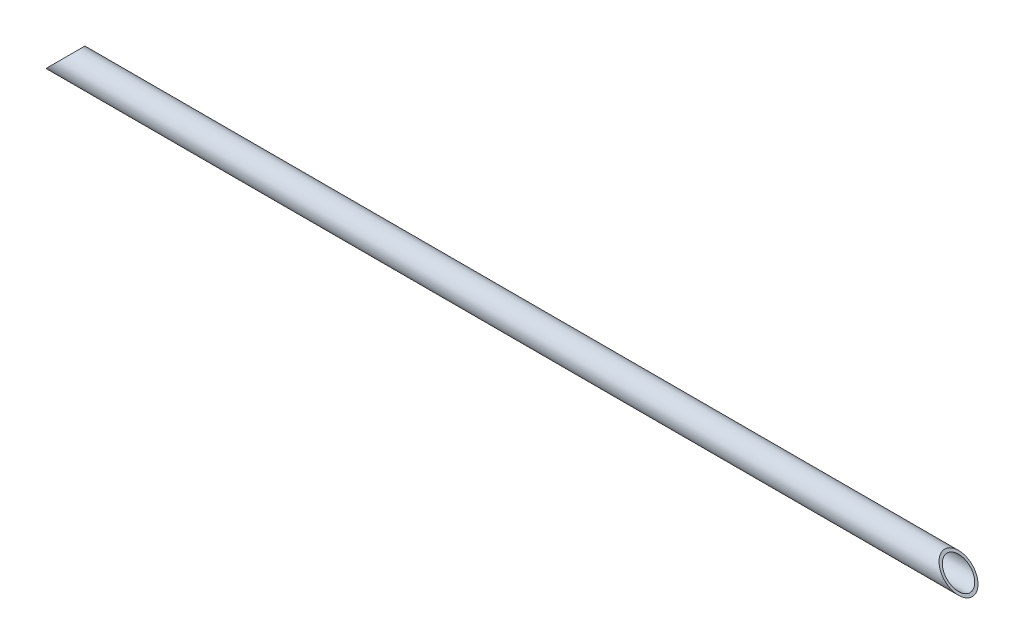
ISO-10303-21;
HEADER;
FILE_DESCRIPTION(('STEP AP214'),'2;1');
FILE_NAME('part.step','',(''),(''),'','','');
FILE_SCHEMA(('AUTOMOTIVE_DESIGN { 1 0 10303 214 1 1 1 1 }'));
ENDSEC;
DATA;
#1=APPLICATION_CONTEXT('core data for automotive mechanical design processes');
#2=APPLICATION_PROTOCOL_DEFINITION('international standard','automotive_design',2000,#1);
#3=PRODUCT_CONTEXT('',#1,'mechanical');
#4=PRODUCT('Part','Part','',(#3));
#5=PRODUCT_RELATED_PRODUCT_CATEGORY('part','',(#4));
#6=PRODUCT_DEFINITION_FORMATION('','',#4);
#7=PRODUCT_DEFINITION_CONTEXT('part definition',#1,'design');
#8=PRODUCT_DEFINITION('design','',#6,#7);
#9=PRODUCT_DEFINITION_SHAPE('','',#8);
#10=(LENGTH_UNIT() NAMED_UNIT(*) SI_UNIT(.MILLI.,.METRE.));
#11=(NAMED_UNIT(*) PLANE_ANGLE_UNIT() SI_UNIT($,.RADIAN.));
#12=(NAMED_UNIT(*) SI_UNIT($,.STERADIAN.) SOLID_ANGLE_UNIT());
#13=UNCERTAINTY_MEASURE_WITH_UNIT(LENGTH_MEASURE(1.E-05),#10,'distance_accuracy_value','');
#14=(GEOMETRIC_REPRESENTATION_CONTEXT(3) GLOBAL_UNCERTAINTY_ASSIGNED_CONTEXT((#13)) GLOBAL_UNIT_ASSIGNED_CONTEXT((#10,
#11,#12)) REPRESENTATION_CONTEXT('',''));
#15=CARTESIAN_POINT('',(0.,0.,0.));
#16=DIRECTION('',(0.,0.,1.));
#17=DIRECTION('',(1.,0.,0.));
#18=AXIS2_PLACEMENT_3D('',#15,#16,#17);
#19=CARTESIAN_POINT('',(704.85,-133.554831147194,21.5490330010652));
#20=DIRECTION('',(1.,0.,0.));
#21=DIRECTION('',(0.,0.,-1.));
#22=AXIS2_PLACEMENT_3D('',#19,#20,#21);
#23=CYLINDRICAL_SURFACE('',#22,17.526);
#24=CARTESIAN_POINT('',(683.768,-133.554831147194,21.5490330010652));
#25=DIRECTION('',(0.707106781186548,0.707106781186547,0.));
#26=DIRECTION('',(0.707106781186547,-0.707106781186548,0.));
#27=AXIS2_PLACEMENT_3D('',#24,#25,#26);
#28=ELLIPSE('',#27,24.7855068941508,17.526);
#29=CARTESIAN_POINT('',(701.294,-151.080831147194,21.5490330010652));
#30=VERTEX_POINT('',#29);
#31=EDGE_CURVE('E24',#30,#30,#28,.F.);
#32=ORIENTED_EDGE('',*,*,#31,.F.);
#33=EDGE_LOOP('',(#32));
#34=FACE_BOUND('',#33,.T.);
#35=CARTESIAN_POINT('',(-683.768,-133.554831147194,21.5490330010652));
#36=DIRECTION('',(-0.707106781186547,0.707106781186548,0.));
#37=DIRECTION('',(0.707106781186548,0.707106781186547,0.));
#38=AXIS2_PLACEMENT_3D('',#35,#36,#37);
#39=ELLIPSE('',#38,24.7855068941509,17.526);
#40=CARTESIAN_POINT('',(-666.242,-116.028831147194,21.5490330010652));
#41=VERTEX_POINT('',#40);
#42=EDGE_CURVE('E15',#41,#41,#39,.F.);
#43=ORIENTED_EDGE('',*,*,#42,.F.);
#44=EDGE_LOOP('',(#43));
#45=FACE_BOUND('',#44,.T.);
#46=ADVANCED_FACE('F12',(#34,#45),#23,.F.);
#47=CARTESIAN_POINT('',(-685.787239538478,-135.574070685672,1502.067630764));
#48=DIRECTION('',(-0.707106781186547,0.707106781186548,0.));
#49=DIRECTION('',(-0.707106781186548,-0.707106781186547,0.));
#50=AXIS2_PLACEMENT_3D('',#47,#48,#49);
#51=PLANE('',#50);
#52=CARTESIAN_POINT('',(-683.768,-133.554831147194,21.5490330010652));
#53=DIRECTION('',(-0.707106781186547,0.707106781186548,0.));
#54=DIRECTION('',(0.707106781186548,0.707106781186547,0.));
#55=AXIS2_PLACEMENT_3D('',#52,#53,#54);
#56=ELLIPSE('',#55,29.8144503219496,21.082);
#57=CARTESIAN_POINT('',(-662.686,-112.472831147194,21.5490330010652));
#58=VERTEX_POINT('',#57);
#59=EDGE_CURVE('E19',#58,#58,#56,.F.);
#60=ORIENTED_EDGE('',*,*,#59,.F.);
#61=EDGE_LOOP('',(#60));
#62=FACE_BOUND('',#61,.T.);
#63=ORIENTED_EDGE('',*,*,#42,.T.);
#64=EDGE_LOOP('',(#63));
#65=FACE_BOUND('',#64,.T.);
#66=ADVANCED_FACE('F32',(#62,#65),#51,.T.);
#67=CARTESIAN_POINT('',(682.893688891362,-132.680520038556,1502.067630764));
#68=DIRECTION('',(0.707106781186548,0.707106781186547,0.));
#69=DIRECTION('',(-0.707106781186547,0.707106781186548,0.));
#70=AXIS2_PLACEMENT_3D('',#67,#68,#69);
#71=PLANE('',#70);
#72=CARTESIAN_POINT('',(683.768,-133.554831147194,21.5490330010652));
#73=DIRECTION('',(0.707106781186548,0.707106781186547,0.));
#74=DIRECTION('',(0.707106781186547,-0.707106781186548,0.));
#75=AXIS2_PLACEMENT_3D('',#72,#73,#74);
#76=ELLIPSE('',#75,29.8144503219496,21.082);
#77=CARTESIAN_POINT('',(704.85,-154.636831147194,21.5490330010652));
#78=VERTEX_POINT('',#77);
#79=EDGE_CURVE('E8',#78,#78,#76,.F.);
#80=ORIENTED_EDGE('',*,*,#79,.F.);
#81=EDGE_LOOP('',(#80));
#82=FACE_BOUND('',#81,.T.);
#83=ORIENTED_EDGE('',*,*,#31,.T.);
#84=EDGE_LOOP('',(#83));
#85=FACE_BOUND('',#84,.T.);
#86=ADVANCED_FACE('F40',(#82,#85),#71,.T.);
#87=CARTESIAN_POINT('',(704.85,-133.554831147194,21.5490330010652));
#88=DIRECTION('',(1.,0.,0.));
#89=DIRECTION('',(0.,0.,-1.));
#90=AXIS2_PLACEMENT_3D('',#87,#88,#89);
#91=CYLINDRICAL_SURFACE('',#90,21.082);
#92=ORIENTED_EDGE('',*,*,#79,.T.);
#93=EDGE_LOOP('',(#92));
#94=FACE_BOUND('',#93,.T.);
#95=ORIENTED_EDGE('',*,*,#59,.T.);
#96=EDGE_LOOP('',(#95));
#97=FACE_BOUND('',#96,.T.);
#98=ADVANCED_FACE('F42',(#94,#97),#91,.T.);
#99=CLOSED_SHELL('',(#46,#66,#86,#98));
#100=MANIFOLD_SOLID_BREP('B1',#99);
#101=ADVANCED_BREP_SHAPE_REPRESENTATION('',(#18,#100),#14);
#102=SHAPE_DEFINITION_REPRESENTATION(#9,#101);
ENDSEC;
END-ISO-10303-21;
